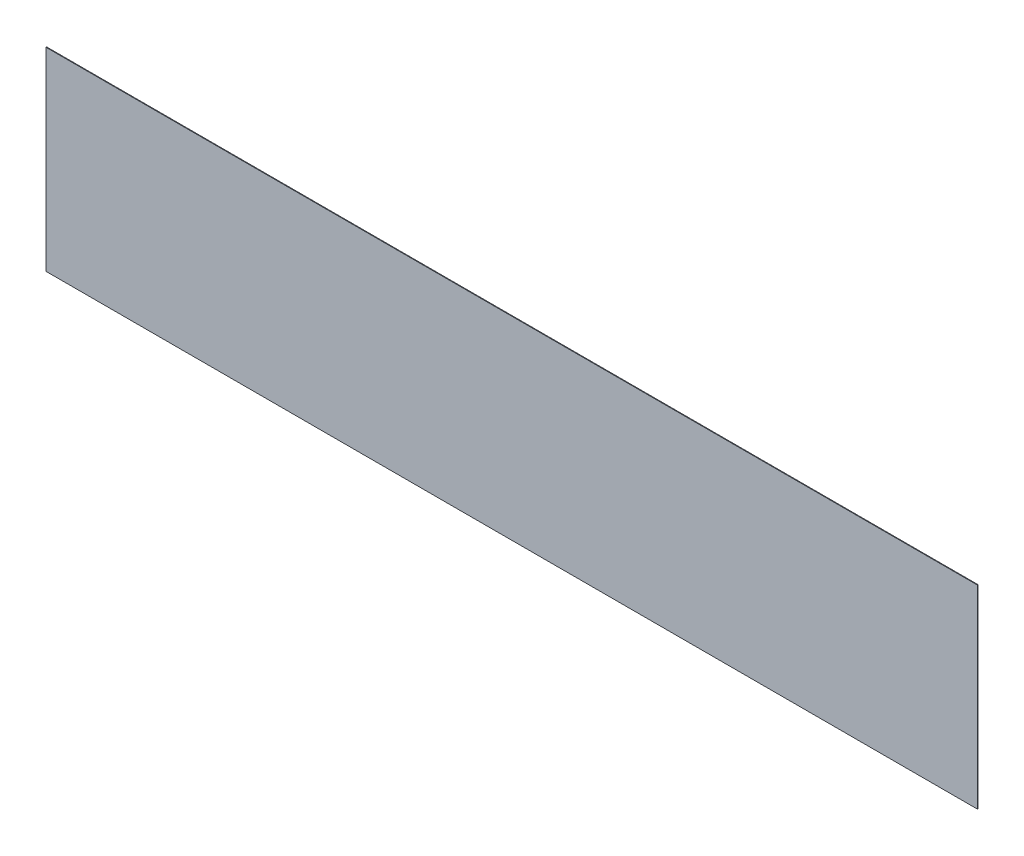
ISO-10303-21;
HEADER;
FILE_DESCRIPTION(('STEP AP214'),'2;1');
FILE_NAME('part.step','',(''),(''),'','','');
FILE_SCHEMA(('AUTOMOTIVE_DESIGN { 1 0 10303 214 1 1 1 1 }'));
ENDSEC;
DATA;
#1=APPLICATION_CONTEXT('core data for automotive mechanical design processes');
#2=APPLICATION_PROTOCOL_DEFINITION('international standard','automotive_design',2000,#1);
#3=PRODUCT_CONTEXT('',#1,'mechanical');
#4=PRODUCT('Part','Part','',(#3));
#5=PRODUCT_RELATED_PRODUCT_CATEGORY('part','',(#4));
#6=PRODUCT_DEFINITION_FORMATION('','',#4);
#7=PRODUCT_DEFINITION_CONTEXT('part definition',#1,'design');
#8=PRODUCT_DEFINITION('design','',#6,#7);
#9=PRODUCT_DEFINITION_SHAPE('','',#8);
#10=(LENGTH_UNIT() NAMED_UNIT(*) SI_UNIT(.MILLI.,.METRE.));
#11=(NAMED_UNIT(*) PLANE_ANGLE_UNIT() SI_UNIT($,.RADIAN.));
#12=(NAMED_UNIT(*) SI_UNIT($,.STERADIAN.) SOLID_ANGLE_UNIT());
#13=UNCERTAINTY_MEASURE_WITH_UNIT(LENGTH_MEASURE(1.E-05),#10,'distance_accuracy_value','');
#14=(GEOMETRIC_REPRESENTATION_CONTEXT(3) GLOBAL_UNCERTAINTY_ASSIGNED_CONTEXT((#13)) GLOBAL_UNIT_ASSIGNED_CONTEXT((#10,
#11,#12)) REPRESENTATION_CONTEXT('',''));
#15=CARTESIAN_POINT('',(0.,0.,0.));
#16=DIRECTION('',(0.,0.,1.));
#17=DIRECTION('',(1.,0.,0.));
#18=AXIS2_PLACEMENT_3D('',#15,#16,#17);
#19=CARTESIAN_POINT('',(1.258952171729E-05,-1.445744393857E-06,0.00100076));
#20=DIRECTION('',(0.,0.,1.));
#21=DIRECTION('',(1.,0.,0.));
#22=AXIS2_PLACEMENT_3D('',#19,#20,#21);
#23=PLANE('',#22);
#24=DIRECTION('',(-1.,0.,0.));
#25=VECTOR('',#24,1.);
#26=CARTESIAN_POINT('',(0.72348598,0.1507744,0.00100076));
#27=LINE('',#26,#25);
#28=CARTESIAN_POINT('',(0.72348598,0.1507744,0.00100076));
#29=VERTEX_POINT('',#28);
#30=CARTESIAN_POINT('',(-0.72343772,0.1507744,0.00100076));
#31=VERTEX_POINT('',#30);
#32=EDGE_CURVE('E79',#29,#31,#27,.T.);
#33=ORIENTED_EDGE('',*,*,#32,.T.);
#34=DIRECTION('',(-0.000160041777324651,-0.999999987193315,0.));
#35=VECTOR('',#34,1.);
#36=CARTESIAN_POINT('',(-0.72343772,0.1507744,0.00100076));
#37=LINE('',#36,#35);
#38=CARTESIAN_POINT('',(-0.72348598,-0.15077186,0.00100076));
#39=VERTEX_POINT('',#38);
#40=EDGE_CURVE('E77',#31,#39,#37,.T.);
#41=ORIENTED_EDGE('',*,*,#40,.T.);
#42=DIRECTION('',(0.999999999998459,-1.7553899226878E-06,0.));
#43=VECTOR('',#42,1.);
#44=CARTESIAN_POINT('',(-0.72348598,-0.15077186,0.00100076));
#45=LINE('',#44,#43);
#46=CARTESIAN_POINT('',(0.72348598,-0.1507744,0.00100076));
#47=VERTEX_POINT('',#46);
#48=EDGE_CURVE('E20',#39,#47,#45,.T.);
#49=ORIENTED_EDGE('',*,*,#48,.T.);
#50=DIRECTION('',(0.,1.,0.));
#51=VECTOR('',#50,1.);
#52=CARTESIAN_POINT('',(0.72348598,-0.1507744,0.00100076));
#53=LINE('',#52,#51);
#54=EDGE_CURVE('E11',#47,#29,#53,.T.);
#55=ORIENTED_EDGE('',*,*,#54,.T.);
#56=EDGE_LOOP('',(#33,#41,#49,#55));
#57=FACE_BOUND('',#56,.T.);
#58=ADVANCED_FACE('F17',(#57),#23,.T.);
#59=CARTESIAN_POINT('',(1.258952171729E-05,-1.445744393857E-06,0.));
#60=DIRECTION('',(0.,0.,1.));
#61=DIRECTION('',(1.,0.,0.));
#62=AXIS2_PLACEMENT_3D('',#59,#60,#61);
#63=PLANE('',#62);
#64=DIRECTION('',(0.,1.,0.));
#65=VECTOR('',#64,1.);
#66=CARTESIAN_POINT('',(0.72348598,-0.1507744,0.));
#67=LINE('',#66,#65);
#68=CARTESIAN_POINT('',(0.72348598,-0.1507744,0.));
#69=VERTEX_POINT('',#68);
#70=CARTESIAN_POINT('',(0.72348598,0.1507744,0.));
#71=VERTEX_POINT('',#70);
#72=EDGE_CURVE('E27',#69,#71,#67,.T.);
#73=ORIENTED_EDGE('',*,*,#72,.F.);
#74=DIRECTION('',(0.999999999998459,-1.7553899226878E-06,0.));
#75=VECTOR('',#74,1.);
#76=CARTESIAN_POINT('',(-0.72348598,-0.15077186,0.));
#77=LINE('',#76,#75);
#78=CARTESIAN_POINT('',(-0.72348598,-0.15077186,0.));
#79=VERTEX_POINT('',#78);
#80=EDGE_CURVE('E84',#79,#69,#77,.T.);
#81=ORIENTED_EDGE('',*,*,#80,.F.);
#82=DIRECTION('',(-0.000160041777324651,-0.999999987193315,0.));
#83=VECTOR('',#82,1.);
#84=CARTESIAN_POINT('',(-0.72343772,0.1507744,0.));
#85=LINE('',#84,#83);
#86=CARTESIAN_POINT('',(-0.72343772,0.1507744,0.));
#87=VERTEX_POINT('',#86);
#88=EDGE_CURVE('E87',#87,#79,#85,.T.);
#89=ORIENTED_EDGE('',*,*,#88,.F.);
#90=DIRECTION('',(-1.,0.,0.));
#91=VECTOR('',#90,1.);
#92=CARTESIAN_POINT('',(0.72348598,0.1507744,0.));
#93=LINE('',#92,#91);
#94=EDGE_CURVE('E165',#71,#87,#93,.T.);
#95=ORIENTED_EDGE('',*,*,#94,.F.);
#96=EDGE_LOOP('',(#73,#81,#89,#95));
#97=FACE_BOUND('',#96,.T.);
#98=ADVANCED_FACE('F137',(#97),#63,.F.);
#99=CARTESIAN_POINT('',(0.72348598,-0.1507744,0.));
#100=DIRECTION('',(-1.,0.,0.));
#101=DIRECTION('',(0.,0.,1.));
#102=AXIS2_PLACEMENT_3D('',#99,#100,#101);
#103=PLANE('',#102);
#104=ORIENTED_EDGE('',*,*,#72,.T.);
#105=DIRECTION('',(0.,0.,1.));
#106=VECTOR('',#105,1.);
#107=CARTESIAN_POINT('',(0.72348598,0.1507744,0.));
#108=LINE('',#107,#106);
#109=EDGE_CURVE('E93',#71,#29,#108,.T.);
#110=ORIENTED_EDGE('',*,*,#109,.T.);
#111=ORIENTED_EDGE('',*,*,#54,.F.);
#112=DIRECTION('',(0.,0.,1.));
#113=VECTOR('',#112,1.);
#114=CARTESIAN_POINT('',(0.72348598,-0.1507744,0.));
#115=LINE('',#114,#113);
#116=EDGE_CURVE('E73',#69,#47,#115,.T.);
#117=ORIENTED_EDGE('',*,*,#116,.F.);
#118=EDGE_LOOP('',(#104,#110,#111,#117));
#119=FACE_BOUND('',#118,.T.);
#120=ADVANCED_FACE('F129',(#119),#103,.F.);
#121=CARTESIAN_POINT('',(-0.72348598,-0.15077186,0.));
#122=DIRECTION('',(1.7553899226878E-06,0.999999999998459,0.));
#123=DIRECTION('',(0.,0.,-1.));
#124=AXIS2_PLACEMENT_3D('',#121,#122,#123);
#125=PLANE('',#124);
#126=ORIENTED_EDGE('',*,*,#80,.T.);
#127=ORIENTED_EDGE('',*,*,#116,.T.);
#128=ORIENTED_EDGE('',*,*,#48,.F.);
#129=DIRECTION('',(0.,0.,1.));
#130=VECTOR('',#129,1.);
#131=CARTESIAN_POINT('',(-0.72348598,-0.15077186,0.));
#132=LINE('',#131,#130);
#133=EDGE_CURVE('E71',#79,#39,#132,.T.);
#134=ORIENTED_EDGE('',*,*,#133,.F.);
#135=EDGE_LOOP('',(#126,#127,#128,#134));
#136=FACE_BOUND('',#135,.T.);
#137=ADVANCED_FACE('F69',(#136),#125,.F.);
#138=CARTESIAN_POINT('',(-0.72343772,0.1507744,0.));
#139=DIRECTION('',(0.999999987193315,-0.000160041777324651,0.));
#140=DIRECTION('',(0.,0.,-1.));
#141=AXIS2_PLACEMENT_3D('',#138,#139,#140);
#142=PLANE('',#141);
#143=ORIENTED_EDGE('',*,*,#88,.T.);
#144=ORIENTED_EDGE('',*,*,#133,.T.);
#145=ORIENTED_EDGE('',*,*,#40,.F.);
#146=DIRECTION('',(0.,0.,1.));
#147=VECTOR('',#146,1.);
#148=CARTESIAN_POINT('',(-0.72343772,0.1507744,0.));
#149=LINE('',#148,#147);
#150=EDGE_CURVE('E170',#87,#31,#149,.T.);
#151=ORIENTED_EDGE('',*,*,#150,.F.);
#152=EDGE_LOOP('',(#143,#144,#145,#151));
#153=FACE_BOUND('',#152,.T.);
#154=ADVANCED_FACE('F86',(#153),#142,.F.);
#155=CARTESIAN_POINT('',(0.72348598,0.1507744,0.));
#156=DIRECTION('',(0.,-1.,0.));
#157=DIRECTION('',(0.,0.,-1.));
#158=AXIS2_PLACEMENT_3D('',#155,#156,#157);
#159=PLANE('',#158);
#160=ORIENTED_EDGE('',*,*,#94,.T.);
#161=ORIENTED_EDGE('',*,*,#150,.T.);
#162=ORIENTED_EDGE('',*,*,#32,.F.);
#163=ORIENTED_EDGE('',*,*,#109,.F.);
#164=EDGE_LOOP('',(#160,#161,#162,#163));
#165=FACE_BOUND('',#164,.T.);
#166=ADVANCED_FACE('F108',(#165),#159,.F.);
#167=CLOSED_SHELL('',(#58,#98,#120,#137,#154,#166));
#168=MANIFOLD_SOLID_BREP('B1',#167);
#169=ADVANCED_BREP_SHAPE_REPRESENTATION('',(#18,#168),#14);
#170=SHAPE_DEFINITION_REPRESENTATION(#9,#169);
ENDSEC;
END-ISO-10303-21;
